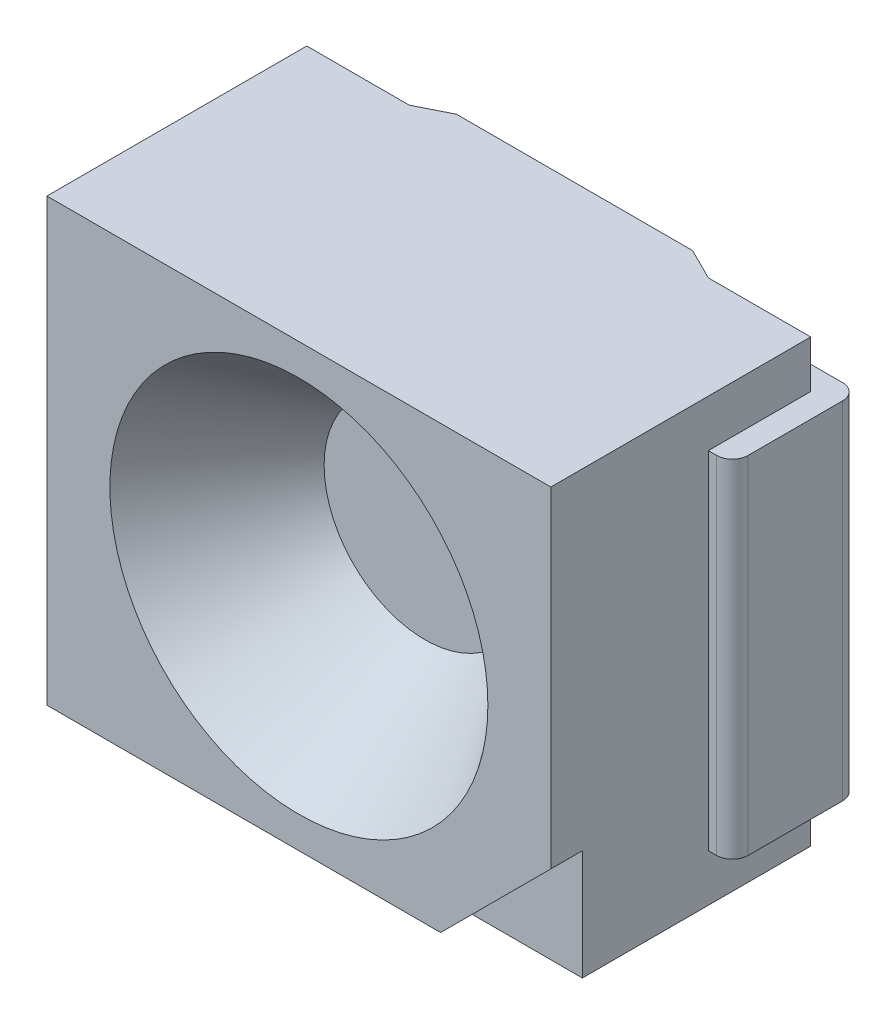
ISO-10303-21;
HEADER;
FILE_DESCRIPTION(('STEP AP214'),'2;1');
FILE_NAME('part.step','',(''),(''),'','','');
FILE_SCHEMA(('AUTOMOTIVE_DESIGN { 1 0 10303 214 1 1 1 1 }'));
ENDSEC;
DATA;
#1=APPLICATION_CONTEXT('core data for automotive mechanical design processes');
#2=APPLICATION_PROTOCOL_DEFINITION('international standard','automotive_design',2000,#1);
#3=PRODUCT_CONTEXT('',#1,'mechanical');
#4=PRODUCT('Part','Part','',(#3));
#5=PRODUCT_RELATED_PRODUCT_CATEGORY('part','',(#4));
#6=PRODUCT_DEFINITION_FORMATION('','',#4);
#7=PRODUCT_DEFINITION_CONTEXT('part definition',#1,'design');
#8=PRODUCT_DEFINITION('design','',#6,#7);
#9=PRODUCT_DEFINITION_SHAPE('','',#8);
#10=(LENGTH_UNIT() NAMED_UNIT(*) SI_UNIT(.MILLI.,.METRE.));
#11=(NAMED_UNIT(*) PLANE_ANGLE_UNIT() SI_UNIT($,.RADIAN.));
#12=(NAMED_UNIT(*) SI_UNIT($,.STERADIAN.) SOLID_ANGLE_UNIT());
#13=UNCERTAINTY_MEASURE_WITH_UNIT(LENGTH_MEASURE(1.E-05),#10,'distance_accuracy_value','');
#14=(GEOMETRIC_REPRESENTATION_CONTEXT(3) GLOBAL_UNCERTAINTY_ASSIGNED_CONTEXT((#13)) GLOBAL_UNIT_ASSIGNED_CONTEXT((#10,
#11,#12)) REPRESENTATION_CONTEXT('',''));
#15=CARTESIAN_POINT('',(0.,0.,0.));
#16=DIRECTION('',(0.,0.,1.));
#17=DIRECTION('',(1.,0.,0.));
#18=AXIS2_PLACEMENT_3D('',#15,#16,#17);
#19=CARTESIAN_POINT('',(3.2,0.,1.75));
#20=DIRECTION('',(-1.,0.,0.));
#21=DIRECTION('',(0.,-1.,0.));
#22=AXIS2_PLACEMENT_3D('',#19,#20,#21);
#23=PLANE('',#22);
#24=DIRECTION('',(0.,0.,-1.));
#25=VECTOR('',#24,1.);
#26=CARTESIAN_POINT('',(3.2,2.5,0.75));
#27=LINE('',#26,#25);
#28=CARTESIAN_POINT('',(3.2,2.5,0.75));
#29=VERTEX_POINT('',#28);
#30=CARTESIAN_POINT('',(3.2,2.5,0.1));
#31=VERTEX_POINT('',#30);
#32=EDGE_CURVE('E221',#29,#31,#27,.T.);
#33=ORIENTED_EDGE('',*,*,#32,.T.);
#34=DIRECTION('',(0.,-1.,0.));
#35=VECTOR('',#34,1.);
#36=CARTESIAN_POINT('',(3.2,2.8,0.1));
#37=LINE('',#36,#35);
#38=CARTESIAN_POINT('',(3.2,2.8,0.1));
#39=VERTEX_POINT('',#38);
#40=EDGE_CURVE('E318',#39,#31,#37,.T.);
#41=ORIENTED_EDGE('',*,*,#40,.F.);
#42=DIRECTION('',(0.,0.,-1.));
#43=VECTOR('',#42,1.);
#44=CARTESIAN_POINT('',(3.2,2.8,1.75));
#45=LINE('',#44,#43);
#46=CARTESIAN_POINT('',(3.2,2.8,1.75));
#47=VERTEX_POINT('',#46);
#48=EDGE_CURVE('E379',#47,#39,#45,.T.);
#49=ORIENTED_EDGE('',*,*,#48,.F.);
#50=DIRECTION('',(0.,1.,0.));
#51=VECTOR('',#50,1.);
#52=CARTESIAN_POINT('',(3.2,0.,1.75));
#53=LINE('',#52,#51);
#54=CARTESIAN_POINT('',(3.2,0.7,1.75));
#55=VERTEX_POINT('',#54);
#56=EDGE_CURVE('E369',#55,#47,#53,.T.);
#57=ORIENTED_EDGE('',*,*,#56,.F.);
#58=DIRECTION('',(0.,0.,1.));
#59=VECTOR('',#58,1.);
#60=CARTESIAN_POINT('',(3.2,0.7,1.55));
#61=LINE('',#60,#59);
#62=CARTESIAN_POINT('',(3.2,0.7,1.55));
#63=VERTEX_POINT('',#62);
#64=EDGE_CURVE('E355',#63,#55,#61,.T.);
#65=ORIENTED_EDGE('',*,*,#64,.F.);
#66=DIRECTION('',(0.,1.,0.));
#67=VECTOR('',#66,1.);
#68=CARTESIAN_POINT('',(3.2,0.,1.55));
#69=LINE('',#68,#67);
#70=CARTESIAN_POINT('',(3.2,0.,1.55));
#71=VERTEX_POINT('',#70);
#72=EDGE_CURVE('E350',#71,#63,#69,.T.);
#73=ORIENTED_EDGE('',*,*,#72,.F.);
#74=DIRECTION('',(0.,0.,-1.));
#75=VECTOR('',#74,1.);
#76=CARTESIAN_POINT('',(3.2,0.,1.75));
#77=LINE('',#76,#75);
#78=CARTESIAN_POINT('',(3.2,0.,0.1));
#79=VERTEX_POINT('',#78);
#80=EDGE_CURVE('E382',#71,#79,#77,.T.);
#81=ORIENTED_EDGE('',*,*,#80,.T.);
#82=CARTESIAN_POINT('',(3.2,0.299999999999999,0.1));
#83=VERTEX_POINT('',#82);
#84=EDGE_CURVE('E308',#83,#79,#37,.T.);
#85=ORIENTED_EDGE('',*,*,#84,.F.);
#86=DIRECTION('',(0.,0.,-1.));
#87=VECTOR('',#86,1.);
#88=CARTESIAN_POINT('',(3.2,0.299999999999999,0.75));
#89=LINE('',#88,#87);
#90=CARTESIAN_POINT('',(3.2,0.299999999999999,0.75));
#91=VERTEX_POINT('',#90);
#92=EDGE_CURVE('E230',#91,#83,#89,.T.);
#93=ORIENTED_EDGE('',*,*,#92,.F.);
#94=DIRECTION('',(0.,-1.,0.));
#95=VECTOR('',#94,1.);
#96=CARTESIAN_POINT('',(3.2,0.299999999999999,0.75));
#97=LINE('',#96,#95);
#98=EDGE_CURVE('E213',#29,#91,#97,.T.);
#99=ORIENTED_EDGE('',*,*,#98,.F.);
#100=EDGE_LOOP('',(#33,#41,#49,#57,#65,#73,#81,#85,#93,#99));
#101=FACE_BOUND('',#100,.T.);
#102=ADVANCED_FACE('F35',(#101),#23,.F.);
#103=CARTESIAN_POINT('',(0.,0.,1.75));
#104=DIRECTION('',(1.,0.,0.));
#105=DIRECTION('',(0.,0.,-1.));
#106=AXIS2_PLACEMENT_3D('',#103,#104,#105);
#107=PLANE('',#106);
#108=DIRECTION('',(0.,0.,-1.));
#109=VECTOR('',#108,1.);
#110=CARTESIAN_POINT('',(0.,0.299999999999999,0.75));
#111=LINE('',#110,#109);
#112=CARTESIAN_POINT('',(0.,0.299999999999999,0.75));
#113=VERTEX_POINT('',#112);
#114=CARTESIAN_POINT('',(0.,0.299999999999999,0.1));
#115=VERTEX_POINT('',#114);
#116=EDGE_CURVE('E248',#113,#115,#111,.T.);
#117=ORIENTED_EDGE('',*,*,#116,.T.);
#118=DIRECTION('',(0.,-1.,0.));
#119=VECTOR('',#118,1.);
#120=CARTESIAN_POINT('',(0.,2.8,0.1));
#121=LINE('',#120,#119);
#122=CARTESIAN_POINT('',(0.,0.,0.1));
#123=VERTEX_POINT('',#122);
#124=EDGE_CURVE('E336',#115,#123,#121,.T.);
#125=ORIENTED_EDGE('',*,*,#124,.T.);
#126=DIRECTION('',(0.,0.,-1.));
#127=VECTOR('',#126,1.);
#128=CARTESIAN_POINT('',(0.,0.,1.75));
#129=LINE('',#128,#127);
#130=CARTESIAN_POINT('',(0.,0.,1.75));
#131=VERTEX_POINT('',#130);
#132=EDGE_CURVE('E385',#131,#123,#129,.T.);
#133=ORIENTED_EDGE('',*,*,#132,.F.);
#134=DIRECTION('',(0.,-1.,0.));
#135=VECTOR('',#134,1.);
#136=CARTESIAN_POINT('',(0.,0.,1.75));
#137=LINE('',#136,#135);
#138=CARTESIAN_POINT('',(0.,2.8,1.75));
#139=VERTEX_POINT('',#138);
#140=EDGE_CURVE('E362',#139,#131,#137,.T.);
#141=ORIENTED_EDGE('',*,*,#140,.F.);
#142=DIRECTION('',(0.,0.,-1.));
#143=VECTOR('',#142,1.);
#144=CARTESIAN_POINT('',(0.,2.8,1.75));
#145=LINE('',#144,#143);
#146=CARTESIAN_POINT('',(0.,2.8,0.1));
#147=VERTEX_POINT('',#146);
#148=EDGE_CURVE('E373',#139,#147,#145,.T.);
#149=ORIENTED_EDGE('',*,*,#148,.T.);
#150=CARTESIAN_POINT('',(0.,2.5,0.1));
#151=VERTEX_POINT('',#150);
#152=EDGE_CURVE('E332',#147,#151,#121,.T.);
#153=ORIENTED_EDGE('',*,*,#152,.T.);
#154=DIRECTION('',(0.,0.,-1.));
#155=VECTOR('',#154,1.);
#156=CARTESIAN_POINT('',(0.,2.5,0.75));
#157=LINE('',#156,#155);
#158=CARTESIAN_POINT('',(0.,2.5,0.75));
#159=VERTEX_POINT('',#158);
#160=EDGE_CURVE('E246',#159,#151,#157,.T.);
#161=ORIENTED_EDGE('',*,*,#160,.F.);
#162=DIRECTION('',(0.,1.,0.));
#163=VECTOR('',#162,1.);
#164=CARTESIAN_POINT('',(0.,2.5,0.75));
#165=LINE('',#164,#163);
#166=EDGE_CURVE('E241',#113,#159,#165,.T.);
#167=ORIENTED_EDGE('',*,*,#166,.F.);
#168=EDGE_LOOP('',(#117,#125,#133,#141,#149,#153,#161,#167));
#169=FACE_BOUND('',#168,.T.);
#170=ADVANCED_FACE('F443',(#169),#107,.F.);
#171=CARTESIAN_POINT('',(0.,2.8,0.1));
#172=DIRECTION('',(0.,0.,1.));
#173=DIRECTION('',(1.,0.,0.));
#174=AXIS2_PLACEMENT_3D('',#171,#172,#173);
#175=PLANE('',#174);
#176=DIRECTION('',(-1.,0.,0.));
#177=VECTOR('',#176,1.);
#178=CARTESIAN_POINT('',(0.65,0.299999999999999,0.1));
#179=LINE('',#178,#177);
#180=CARTESIAN_POINT('',(0.65,0.299999999999999,0.1));
#181=VERTEX_POINT('',#180);
#182=EDGE_CURVE('E263',#181,#115,#179,.T.);
#183=ORIENTED_EDGE('',*,*,#182,.F.);
#184=DIRECTION('',(0.,-1.,0.));
#185=VECTOR('',#184,1.);
#186=CARTESIAN_POINT('',(0.65,2.8,0.1));
#187=LINE('',#186,#185);
#188=CARTESIAN_POINT('',(0.65,0.,0.1));
#189=VERTEX_POINT('',#188);
#190=EDGE_CURVE('E340',#181,#189,#187,.T.);
#191=ORIENTED_EDGE('',*,*,#190,.T.);
#192=DIRECTION('',(-1.,0.,0.));
#193=VECTOR('',#192,1.);
#194=CARTESIAN_POINT('',(0.,0.,0.1));
#195=LINE('',#194,#193);
#196=EDGE_CURVE('E324',#189,#123,#195,.T.);
#197=ORIENTED_EDGE('',*,*,#196,.T.);
#198=ORIENTED_EDGE('',*,*,#124,.F.);
#199=EDGE_LOOP('',(#183,#191,#197,#198));
#200=FACE_BOUND('',#199,.T.);
#201=ADVANCED_FACE('F457',(#200),#175,.F.);
#202=DIRECTION('',(1.,0.,0.));
#203=VECTOR('',#202,1.);
#204=CARTESIAN_POINT('',(0.65,2.5,0.1));
#205=LINE('',#204,#203);
#206=CARTESIAN_POINT('',(0.65,2.5,0.1));
#207=VERTEX_POINT('',#206);
#208=EDGE_CURVE('E255',#151,#207,#205,.T.);
#209=ORIENTED_EDGE('',*,*,#208,.F.);
#210=ORIENTED_EDGE('',*,*,#152,.F.);
#211=DIRECTION('',(-1.,0.,0.));
#212=VECTOR('',#211,1.);
#213=CARTESIAN_POINT('',(0.,2.8,0.1));
#214=LINE('',#213,#212);
#215=CARTESIAN_POINT('',(0.65,2.8,0.1));
#216=VERTEX_POINT('',#215);
#217=EDGE_CURVE('E323',#216,#147,#214,.T.);
#218=ORIENTED_EDGE('',*,*,#217,.F.);
#219=EDGE_CURVE('E337',#216,#207,#187,.T.);
#220=ORIENTED_EDGE('',*,*,#219,.T.);
#221=EDGE_LOOP('',(#209,#210,#218,#220));
#222=FACE_BOUND('',#221,.T.);
#223=ADVANCED_FACE('F447',(#222),#175,.F.);
#224=CARTESIAN_POINT('',(2.55,2.8,0.1));
#225=DIRECTION('',(0.,0.,1.));
#226=DIRECTION('',(1.,0.,0.));
#227=AXIS2_PLACEMENT_3D('',#224,#225,#226);
#228=PLANE('',#227);
#229=DIRECTION('',(-1.,0.,0.));
#230=VECTOR('',#229,1.);
#231=CARTESIAN_POINT('',(2.55,0.299999999999999,0.1));
#232=LINE('',#231,#230);
#233=CARTESIAN_POINT('',(2.55245720732132,0.299999999999999,0.1));
#234=VERTEX_POINT('',#233);
#235=EDGE_CURVE('E388',#83,#234,#232,.T.);
#236=ORIENTED_EDGE('',*,*,#235,.F.);
#237=ORIENTED_EDGE('',*,*,#84,.T.);
#238=DIRECTION('',(-1.,0.,0.));
#239=VECTOR('',#238,1.);
#240=CARTESIAN_POINT('',(2.55,0.,0.1));
#241=LINE('',#240,#239);
#242=CARTESIAN_POINT('',(2.55,0.,0.1));
#243=VERTEX_POINT('',#242);
#244=EDGE_CURVE('E300',#79,#243,#241,.T.);
#245=ORIENTED_EDGE('',*,*,#244,.T.);
#246=DIRECTION('',(0.,-1.,0.));
#247=VECTOR('',#246,1.);
#248=CARTESIAN_POINT('',(2.55,2.8,0.1));
#249=LINE('',#248,#247);
#250=CARTESIAN_POINT('',(2.55,2.8,0.1));
#251=VERTEX_POINT('',#250);
#252=EDGE_CURVE('E316',#251,#243,#249,.T.);
#253=ORIENTED_EDGE('',*,*,#252,.F.);
#254=DIRECTION('',(-1.,0.,0.));
#255=VECTOR('',#254,1.);
#256=CARTESIAN_POINT('',(2.55,2.8,0.1));
#257=LINE('',#256,#255);
#258=EDGE_CURVE('E301',#39,#251,#257,.T.);
#259=ORIENTED_EDGE('',*,*,#258,.F.);
#260=ORIENTED_EDGE('',*,*,#40,.T.);
#261=DIRECTION('',(1.,0.,0.));
#262=VECTOR('',#261,1.);
#263=CARTESIAN_POINT('',(3.35245720732132,2.5,0.1));
#264=LINE('',#263,#262);
#265=CARTESIAN_POINT('',(2.55245720732132,2.5,0.1));
#266=VERTEX_POINT('',#265);
#267=EDGE_CURVE('E225',#266,#31,#264,.T.);
#268=ORIENTED_EDGE('',*,*,#267,.F.);
#269=DIRECTION('',(0.,1.,0.));
#270=VECTOR('',#269,1.);
#271=CARTESIAN_POINT('',(2.55245720732132,2.5,0.1));
#272=LINE('',#271,#270);
#273=EDGE_CURVE('E278',#234,#266,#272,.T.);
#274=ORIENTED_EDGE('',*,*,#273,.F.);
#275=EDGE_LOOP('',(#236,#237,#245,#253,#259,#260,#268,#274));
#276=FACE_BOUND('',#275,.T.);
#277=ADVANCED_FACE('F486',(#276),#228,.F.);
#278=CARTESIAN_POINT('',(0.,0.,1.75));
#279=DIRECTION('',(0.,1.,0.));
#280=DIRECTION('',(0.,0.,1.));
#281=AXIS2_PLACEMENT_3D('',#278,#279,#280);
#282=PLANE('',#281);
#283=DIRECTION('',(1.,0.,0.));
#284=VECTOR('',#283,1.);
#285=CARTESIAN_POINT('',(0.,0.,0.));
#286=LINE('',#285,#284);
#287=CARTESIAN_POINT('',(0.85,0.,0.));
#288=VERTEX_POINT('',#287);
#289=CARTESIAN_POINT('',(2.35,0.,0.));
#290=VERTEX_POINT('',#289);
#291=EDGE_CURVE('E360',#288,#290,#286,.T.);
#292=ORIENTED_EDGE('',*,*,#291,.T.);
#293=DIRECTION('',(-0.894427190999916,0.,-0.447213595499959));
#294=VECTOR('',#293,1.);
#295=CARTESIAN_POINT('',(2.55,0.,0.1));
#296=LINE('',#295,#294);
#297=EDGE_CURVE('E305',#243,#290,#296,.T.);
#298=ORIENTED_EDGE('',*,*,#297,.F.);
#299=ORIENTED_EDGE('',*,*,#244,.F.);
#300=ORIENTED_EDGE('',*,*,#80,.F.);
#301=DIRECTION('',(1.,0.,0.));
#302=VECTOR('',#301,1.);
#303=CARTESIAN_POINT('',(2.5,0.,1.55));
#304=LINE('',#303,#302);
#305=CARTESIAN_POINT('',(2.5,0.,1.55));
#306=VERTEX_POINT('',#305);
#307=EDGE_CURVE('E348',#306,#71,#304,.T.);
#308=ORIENTED_EDGE('',*,*,#307,.F.);
#309=DIRECTION('',(0.,0.,1.));
#310=VECTOR('',#309,1.);
#311=CARTESIAN_POINT('',(2.5,0.,1.55));
#312=LINE('',#311,#310);
#313=CARTESIAN_POINT('',(2.5,0.,1.75));
#314=VERTEX_POINT('',#313);
#315=EDGE_CURVE('E357',#306,#314,#312,.T.);
#316=ORIENTED_EDGE('',*,*,#315,.T.);
#317=DIRECTION('',(1.,0.,0.));
#318=VECTOR('',#317,1.);
#319=CARTESIAN_POINT('',(0.,0.,1.75));
#320=LINE('',#319,#318);
#321=EDGE_CURVE('E365',#131,#314,#320,.T.);
#322=ORIENTED_EDGE('',*,*,#321,.F.);
#323=ORIENTED_EDGE('',*,*,#132,.T.);
#324=ORIENTED_EDGE('',*,*,#196,.F.);
#325=DIRECTION('',(-0.894427190999916,0.,0.447213595499959));
#326=VECTOR('',#325,1.);
#327=CARTESIAN_POINT('',(0.65,0.,0.1));
#328=LINE('',#327,#326);
#329=EDGE_CURVE('E315',#288,#189,#328,.T.);
#330=ORIENTED_EDGE('',*,*,#329,.F.);
#331=EDGE_LOOP('',(#292,#298,#299,#300,#308,#316,#322,#323,#324,#330));
#332=FACE_BOUND('',#331,.T.);
#333=ADVANCED_FACE('F462',(#332),#282,.F.);
#334=CARTESIAN_POINT('',(0.,2.8,1.75));
#335=DIRECTION('',(0.,-1.,0.));
#336=DIRECTION('',(0.,0.,-1.));
#337=AXIS2_PLACEMENT_3D('',#334,#335,#336);
#338=PLANE('',#337);
#339=ORIENTED_EDGE('',*,*,#258,.T.);
#340=DIRECTION('',(-0.894427190999916,0.,-0.447213595499959));
#341=VECTOR('',#340,1.);
#342=CARTESIAN_POINT('',(2.55,2.8,0.1));
#343=LINE('',#342,#341);
#344=CARTESIAN_POINT('',(2.35,2.8,0.));
#345=VERTEX_POINT('',#344);
#346=EDGE_CURVE('E304',#251,#345,#343,.T.);
#347=ORIENTED_EDGE('',*,*,#346,.T.);
#348=DIRECTION('',(-1.,0.,0.));
#349=VECTOR('',#348,1.);
#350=CARTESIAN_POINT('',(0.,2.8,0.));
#351=LINE('',#350,#349);
#352=CARTESIAN_POINT('',(0.85,2.8,0.));
#353=VERTEX_POINT('',#352);
#354=EDGE_CURVE('E366',#345,#353,#351,.T.);
#355=ORIENTED_EDGE('',*,*,#354,.T.);
#356=DIRECTION('',(-0.894427190999916,0.,0.447213595499959));
#357=VECTOR('',#356,1.);
#358=CARTESIAN_POINT('',(0.65,2.8,0.1));
#359=LINE('',#358,#357);
#360=EDGE_CURVE('E320',#353,#216,#359,.T.);
#361=ORIENTED_EDGE('',*,*,#360,.T.);
#362=ORIENTED_EDGE('',*,*,#217,.T.);
#363=ORIENTED_EDGE('',*,*,#148,.F.);
#364=DIRECTION('',(-1.,0.,0.));
#365=VECTOR('',#364,1.);
#366=CARTESIAN_POINT('',(0.,2.8,1.75));
#367=LINE('',#366,#365);
#368=EDGE_CURVE('E371',#47,#139,#367,.T.);
#369=ORIENTED_EDGE('',*,*,#368,.F.);
#370=ORIENTED_EDGE('',*,*,#48,.T.);
#371=EDGE_LOOP('',(#339,#347,#355,#361,#362,#363,#369,#370));
#372=FACE_BOUND('',#371,.T.);
#373=ADVANCED_FACE('F473',(#372),#338,.F.);
#374=CARTESIAN_POINT('',(0.,0.,1.75));
#375=DIRECTION('',(0.,0.,-1.));
#376=DIRECTION('',(-1.,0.,0.));
#377=AXIS2_PLACEMENT_3D('',#374,#375,#376);
#378=PLANE('',#377);
#379=CARTESIAN_POINT('',(1.6,1.4,1.75));
#380=DIRECTION('',(0.,0.,1.));
#381=DIRECTION('',(1.,0.,0.));
#382=AXIS2_PLACEMENT_3D('',#379,#380,#381);
#383=CIRCLE('',#382,1.2);
#384=CARTESIAN_POINT('',(2.8,1.4,1.75));
#385=VERTEX_POINT('',#384);
#386=EDGE_CURVE('E335',#385,#385,#383,.T.);
#387=ORIENTED_EDGE('',*,*,#386,.F.);
#388=EDGE_LOOP('',(#387));
#389=FACE_BOUND('',#388,.T.);
#390=ORIENTED_EDGE('',*,*,#321,.T.);
#391=DIRECTION('',(-0.707106781186548,-0.707106781186547,0.));
#392=VECTOR('',#391,1.);
#393=CARTESIAN_POINT('',(3.2,0.7,1.75));
#394=LINE('',#393,#392);
#395=EDGE_CURVE('E347',#55,#314,#394,.T.);
#396=ORIENTED_EDGE('',*,*,#395,.F.);
#397=ORIENTED_EDGE('',*,*,#56,.T.);
#398=ORIENTED_EDGE('',*,*,#368,.T.);
#399=ORIENTED_EDGE('',*,*,#140,.T.);
#400=EDGE_LOOP('',(#390,#396,#397,#398,#399));
#401=FACE_BOUND('',#400,.T.);
#402=ADVANCED_FACE('F467',(#389,#401),#378,.F.);
#403=CARTESIAN_POINT('',(0.,0.,0.));
#404=DIRECTION('',(0.,0.,-1.));
#405=DIRECTION('',(-1.,0.,0.));
#406=AXIS2_PLACEMENT_3D('',#403,#404,#405);
#407=PLANE('',#406);
#408=CARTESIAN_POINT('',(1.6,1.4,0.));
#409=DIRECTION('',(0.,0.,-1.));
#410=DIRECTION('',(-1.,0.,0.));
#411=AXIS2_PLACEMENT_3D('',#408,#409,#410);
#412=CIRCLE('',#411,0.3);
#413=CARTESIAN_POINT('',(1.3,1.4,0.));
#414=VERTEX_POINT('',#413);
#415=EDGE_CURVE('E569',#414,#414,#412,.T.);
#416=ORIENTED_EDGE('',*,*,#415,.F.);
#417=EDGE_LOOP('',(#416));
#418=FACE_BOUND('',#417,.T.);
#419=DIRECTION('',(0.,-1.,0.));
#420=VECTOR('',#419,1.);
#421=CARTESIAN_POINT('',(2.35,2.8,0.));
#422=LINE('',#421,#420);
#423=EDGE_CURVE('E312',#345,#290,#422,.T.);
#424=ORIENTED_EDGE('',*,*,#423,.T.);
#425=ORIENTED_EDGE('',*,*,#291,.F.);
#426=DIRECTION('',(0.,-1.,0.));
#427=VECTOR('',#426,1.);
#428=CARTESIAN_POINT('',(0.85,2.8,0.));
#429=LINE('',#428,#427);
#430=EDGE_CURVE('E327',#353,#288,#429,.T.);
#431=ORIENTED_EDGE('',*,*,#430,.F.);
#432=ORIENTED_EDGE('',*,*,#354,.F.);
#433=EDGE_LOOP('',(#424,#425,#431,#432));
#434=FACE_BOUND('',#433,.T.);
#435=ADVANCED_FACE('F477',(#418,#434),#407,.T.);
#436=CARTESIAN_POINT('',(3.2,0.7,1.55));
#437=DIRECTION('',(-0.707106781186548,0.707106781186548,0.));
#438=DIRECTION('',(-0.707106781186548,-0.707106781186548,0.));
#439=AXIS2_PLACEMENT_3D('',#436,#437,#438);
#440=PLANE('',#439);
#441=ORIENTED_EDGE('',*,*,#395,.T.);
#442=ORIENTED_EDGE('',*,*,#315,.F.);
#443=DIRECTION('',(-0.707106781186548,-0.707106781186547,0.));
#444=VECTOR('',#443,1.);
#445=CARTESIAN_POINT('',(3.2,0.7,1.55));
#446=LINE('',#445,#444);
#447=EDGE_CURVE('E352',#63,#306,#446,.T.);
#448=ORIENTED_EDGE('',*,*,#447,.F.);
#449=ORIENTED_EDGE('',*,*,#64,.T.);
#450=EDGE_LOOP('',(#441,#442,#448,#449));
#451=FACE_BOUND('',#450,.T.);
#452=ADVANCED_FACE('F493',(#451),#440,.F.);
#453=CARTESIAN_POINT('',(0.,0.,1.55));
#454=DIRECTION('',(0.,0.,1.));
#455=DIRECTION('',(1.,0.,0.));
#456=AXIS2_PLACEMENT_3D('',#453,#454,#455);
#457=PLANE('',#456);
#458=ORIENTED_EDGE('',*,*,#307,.T.);
#459=ORIENTED_EDGE('',*,*,#72,.T.);
#460=ORIENTED_EDGE('',*,*,#447,.T.);
#461=EDGE_LOOP('',(#458,#459,#460));
#462=FACE_BOUND('',#461,.T.);
#463=ADVANCED_FACE('F490',(#462),#457,.T.);
#464=CARTESIAN_POINT('',(1.6,1.4,1.75));
#465=DIRECTION('',(0.,0.,1.));
#466=DIRECTION('',(1.,0.,0.));
#467=AXIS2_PLACEMENT_3D('',#464,#465,#466);
#468=CONICAL_SURFACE('',#467,1.2,0.610865238198016);
#469=CARTESIAN_POINT('',(1.6,1.4,0.95));
#470=DIRECTION('',(0.,0.,1.));
#471=DIRECTION('',(1.,0.,0.));
#472=AXIS2_PLACEMENT_3D('',#469,#470,#471);
#473=CIRCLE('',#472,0.639833969432232);
#474=CARTESIAN_POINT('',(2.23983396943223,1.4,0.95));
#475=VERTEX_POINT('',#474);
#476=EDGE_CURVE('E344',#475,#475,#473,.T.);
#477=ORIENTED_EDGE('',*,*,#476,.F.);
#478=EDGE_LOOP('',(#477));
#479=FACE_BOUND('',#478,.T.);
#480=ORIENTED_EDGE('',*,*,#386,.T.);
#481=EDGE_LOOP('',(#480));
#482=FACE_BOUND('',#481,.T.);
#483=ADVANCED_FACE('F552',(#479,#482),#468,.F.);
#484=CARTESIAN_POINT('',(1.6,1.4,0.95));
#485=DIRECTION('',(0.,0.,1.));
#486=DIRECTION('',(1.,0.,0.));
#487=AXIS2_PLACEMENT_3D('',#484,#485,#486);
#488=PLANE('',#487);
#489=ORIENTED_EDGE('',*,*,#476,.T.);
#490=EDGE_LOOP('',(#489));
#491=FACE_BOUND('',#490,.T.);
#492=ADVANCED_FACE('F549',(#491),#488,.T.);
#493=CARTESIAN_POINT('',(0.65,2.8,0.1));
#494=DIRECTION('',(0.447213595499959,0.,0.894427190999916));
#495=DIRECTION('',(0.894427190999916,0.,-0.447213595499959));
#496=AXIS2_PLACEMENT_3D('',#493,#494,#495);
#497=PLANE('',#496);
#498=ORIENTED_EDGE('',*,*,#329,.T.);
#499=ORIENTED_EDGE('',*,*,#190,.F.);
#500=DIRECTION('',(0.,-1.,0.));
#501=VECTOR('',#500,1.);
#502=CARTESIAN_POINT('',(0.65,2.5,0.1));
#503=LINE('',#502,#501);
#504=EDGE_CURVE('E250',#207,#181,#503,.T.);
#505=ORIENTED_EDGE('',*,*,#504,.F.);
#506=ORIENTED_EDGE('',*,*,#219,.F.);
#507=ORIENTED_EDGE('',*,*,#360,.F.);
#508=ORIENTED_EDGE('',*,*,#430,.T.);
#509=EDGE_LOOP('',(#498,#499,#505,#506,#507,#508));
#510=FACE_BOUND('',#509,.T.);
#511=ADVANCED_FACE('F451',(#510),#497,.F.);
#512=CARTESIAN_POINT('',(2.55,2.8,0.1));
#513=DIRECTION('',(-0.447213595499959,0.,0.894427190999916));
#514=DIRECTION('',(0.894427190999916,0.,0.447213595499959));
#515=AXIS2_PLACEMENT_3D('',#512,#513,#514);
#516=PLANE('',#515);
#517=ORIENTED_EDGE('',*,*,#297,.T.);
#518=ORIENTED_EDGE('',*,*,#423,.F.);
#519=ORIENTED_EDGE('',*,*,#346,.F.);
#520=ORIENTED_EDGE('',*,*,#252,.T.);
#521=EDGE_LOOP('',(#517,#518,#519,#520));
#522=FACE_BOUND('',#521,.T.);
#523=ADVANCED_FACE('F483',(#522),#516,.F.);
#524=CARTESIAN_POINT('',(3.35245720732132,2.5,-0.0499999999999995));
#525=DIRECTION('',(-1.,0.,0.));
#526=DIRECTION('',(0.,0.,1.));
#527=AXIS2_PLACEMENT_3D('',#524,#525,#526);
#528=PLANE('',#527);
#529=DIRECTION('',(0.,0.,1.));
#530=VECTOR('',#529,1.);
#531=CARTESIAN_POINT('',(3.35245720732132,0.299999999999999,-0.0499999999999995));
#532=LINE('',#531,#530);
#533=CARTESIAN_POINT('',(3.35245720732132,0.299999999999999,0.0500000000000005));
#534=VERTEX_POINT('',#533);
#535=CARTESIAN_POINT('',(3.35245720732132,0.299999999999999,0.65));
#536=VERTEX_POINT('',#535);
#537=EDGE_CURVE('E297',#534,#536,#532,.T.);
#538=ORIENTED_EDGE('',*,*,#537,.F.);
#539=DIRECTION('',(0.,-1.,0.));
#540=VECTOR('',#539,1.);
#541=CARTESIAN_POINT('',(3.35245720732132,2.5,0.0500000000000005));
#542=LINE('',#541,#540);
#543=CARTESIAN_POINT('',(3.35245720732132,2.5,0.0500000000000005));
#544=VERTEX_POINT('',#543);
#545=EDGE_CURVE('E400',#534,#544,#542,.F.);
#546=ORIENTED_EDGE('',*,*,#545,.T.);
#547=DIRECTION('',(0.,0.,1.));
#548=VECTOR('',#547,1.);
#549=CARTESIAN_POINT('',(3.35245720732132,2.5,-0.0499999999999995));
#550=LINE('',#549,#548);
#551=CARTESIAN_POINT('',(3.35245720732132,2.5,0.65));
#552=VERTEX_POINT('',#551);
#553=EDGE_CURVE('E286',#544,#552,#550,.T.);
#554=ORIENTED_EDGE('',*,*,#553,.T.);
#555=DIRECTION('',(0.,1.,0.));
#556=VECTOR('',#555,1.);
#557=CARTESIAN_POINT('',(3.35245720732132,0.299999999999999,0.65));
#558=LINE('',#557,#556);
#559=EDGE_CURVE('E398',#552,#536,#558,.F.);
#560=ORIENTED_EDGE('',*,*,#559,.T.);
#561=EDGE_LOOP('',(#538,#546,#554,#560));
#562=FACE_BOUND('',#561,.T.);
#563=ADVANCED_FACE('F513',(#562),#528,.F.);
#564=CARTESIAN_POINT('',(3.35245720732132,0.299999999999999,-0.0499999999999995));
#565=DIRECTION('',(0.,1.,0.));
#566=DIRECTION('',(0.,0.,1.));
#567=AXIS2_PLACEMENT_3D('',#564,#565,#566);
#568=PLANE('',#567);
#569=DIRECTION('',(-1.,0.,0.));
#570=VECTOR('',#569,1.);
#571=CARTESIAN_POINT('',(3.35245720732132,0.299999999999999,-0.0499999999999995));
#572=LINE('',#571,#570);
#573=CARTESIAN_POINT('',(3.25245720732132,0.299999999999999,-0.0499999999999995));
#574=VERTEX_POINT('',#573);
#575=CARTESIAN_POINT('',(2.55245720732132,0.299999999999999,-0.0499999999999995));
#576=VERTEX_POINT('',#575);
#577=EDGE_CURVE('E279',#574,#576,#572,.T.);
#578=ORIENTED_EDGE('',*,*,#577,.F.);
#579=CARTESIAN_POINT('',(3.25245720732132,0.299999999999999,0.0500000000000005));
#580=DIRECTION('',(0.,1.,0.));
#581=DIRECTION('',(0.,0.,1.));
#582=AXIS2_PLACEMENT_3D('',#579,#580,#581);
#583=CIRCLE('',#582,0.1);
#584=EDGE_CURVE('E396',#574,#534,#583,.F.);
#585=ORIENTED_EDGE('',*,*,#584,.T.);
#586=ORIENTED_EDGE('',*,*,#537,.T.);
#587=CARTESIAN_POINT('',(3.25245720732132,0.299999999999999,0.65));
#588=DIRECTION('',(0.,1.,0.));
#589=DIRECTION('',(0.,0.,1.));
#590=AXIS2_PLACEMENT_3D('',#587,#588,#589);
#591=CIRCLE('',#590,0.1);
#592=CARTESIAN_POINT('',(3.25245720732132,0.299999999999999,0.75));
#593=VERTEX_POINT('',#592);
#594=EDGE_CURVE('E394',#536,#593,#591,.F.);
#595=ORIENTED_EDGE('',*,*,#594,.T.);
#596=DIRECTION('',(1.,0.,0.));
#597=VECTOR('',#596,1.);
#598=CARTESIAN_POINT('',(3.35245720732132,0.299999999999999,0.75));
#599=LINE('',#598,#597);
#600=EDGE_CURVE('E234',#91,#593,#599,.T.);
#601=ORIENTED_EDGE('',*,*,#600,.F.);
#602=ORIENTED_EDGE('',*,*,#92,.T.);
#603=ORIENTED_EDGE('',*,*,#235,.T.);
#604=DIRECTION('',(0.,0.,1.));
#605=VECTOR('',#604,1.);
#606=CARTESIAN_POINT('',(2.55245720732132,0.299999999999999,-0.0499999999999995));
#607=LINE('',#606,#605);
#608=EDGE_CURVE('E294',#576,#234,#607,.T.);
#609=ORIENTED_EDGE('',*,*,#608,.F.);
#610=EDGE_LOOP('',(#578,#585,#586,#595,#601,#602,#603,#609));
#611=FACE_BOUND('',#610,.T.);
#612=ADVANCED_FACE('F510',(#611),#568,.F.);
#613=CARTESIAN_POINT('',(2.55245720732132,2.5,-0.0499999999999995));
#614=DIRECTION('',(1.,0.,0.));
#615=DIRECTION('',(0.,1.,0.));
#616=AXIS2_PLACEMENT_3D('',#613,#614,#615);
#617=PLANE('',#616);
#618=ORIENTED_EDGE('',*,*,#273,.T.);
#619=DIRECTION('',(0.,0.,1.));
#620=VECTOR('',#619,1.);
#621=CARTESIAN_POINT('',(2.55245720732132,2.5,-0.0499999999999995));
#622=LINE('',#621,#620);
#623=CARTESIAN_POINT('',(2.55245720732132,2.5,-0.0499999999999995));
#624=VERTEX_POINT('',#623);
#625=EDGE_CURVE('E292',#624,#266,#622,.T.);
#626=ORIENTED_EDGE('',*,*,#625,.F.);
#627=DIRECTION('',(0.,1.,0.));
#628=VECTOR('',#627,1.);
#629=CARTESIAN_POINT('',(2.55245720732132,2.5,-0.0499999999999995));
#630=LINE('',#629,#628);
#631=EDGE_CURVE('E281',#576,#624,#630,.T.);
#632=ORIENTED_EDGE('',*,*,#631,.F.);
#633=ORIENTED_EDGE('',*,*,#608,.T.);
#634=EDGE_LOOP('',(#618,#626,#632,#633));
#635=FACE_BOUND('',#634,.T.);
#636=ADVANCED_FACE('F496',(#635),#617,.F.);
#637=CARTESIAN_POINT('',(3.35245720732132,2.5,-0.0499999999999995));
#638=DIRECTION('',(0.,-1.,0.));
#639=DIRECTION('',(0.,0.,-1.));
#640=AXIS2_PLACEMENT_3D('',#637,#638,#639);
#641=PLANE('',#640);
#642=ORIENTED_EDGE('',*,*,#553,.F.);
#643=CARTESIAN_POINT('',(3.25245720732132,2.5,0.0500000000000005));
#644=DIRECTION('',(0.,-1.,0.));
#645=DIRECTION('',(0.,0.,-1.));
#646=AXIS2_PLACEMENT_3D('',#643,#644,#645);
#647=CIRCLE('',#646,0.1);
#648=CARTESIAN_POINT('',(3.25245720732132,2.5,-0.0499999999999995));
#649=VERTEX_POINT('',#648);
#650=EDGE_CURVE('E404',#544,#649,#647,.F.);
#651=ORIENTED_EDGE('',*,*,#650,.T.);
#652=DIRECTION('',(1.,0.,0.));
#653=VECTOR('',#652,1.);
#654=CARTESIAN_POINT('',(3.35245720732132,2.5,-0.0499999999999995));
#655=LINE('',#654,#653);
#656=EDGE_CURVE('E283',#624,#649,#655,.T.);
#657=ORIENTED_EDGE('',*,*,#656,.F.);
#658=ORIENTED_EDGE('',*,*,#625,.T.);
#659=ORIENTED_EDGE('',*,*,#267,.T.);
#660=ORIENTED_EDGE('',*,*,#32,.F.);
#661=DIRECTION('',(-1.,0.,0.));
#662=VECTOR('',#661,1.);
#663=CARTESIAN_POINT('',(3.35245720732132,2.5,0.75));
#664=LINE('',#663,#662);
#665=CARTESIAN_POINT('',(3.25245720732132,2.5,0.75));
#666=VERTEX_POINT('',#665);
#667=EDGE_CURVE('E208',#666,#29,#664,.T.);
#668=ORIENTED_EDGE('',*,*,#667,.F.);
#669=CARTESIAN_POINT('',(3.25245720732132,2.5,0.65));
#670=DIRECTION('',(0.,-1.,0.));
#671=DIRECTION('',(0.,0.,-1.));
#672=AXIS2_PLACEMENT_3D('',#669,#670,#671);
#673=CIRCLE('',#672,0.1);
#674=EDGE_CURVE('E402',#666,#552,#673,.F.);
#675=ORIENTED_EDGE('',*,*,#674,.T.);
#676=EDGE_LOOP('',(#642,#651,#657,#658,#659,#660,#668,#675));
#677=FACE_BOUND('',#676,.T.);
#678=ADVANCED_FACE('F223',(#677),#641,.F.);
#679=CARTESIAN_POINT('',(0.,0.,-0.0499999999999995));
#680=DIRECTION('',(0.,0.,-1.));
#681=DIRECTION('',(-1.,0.,0.));
#682=AXIS2_PLACEMENT_3D('',#679,#680,#681);
#683=PLANE('',#682);
#684=ORIENTED_EDGE('',*,*,#656,.T.);
#685=DIRECTION('',(0.,-1.,0.));
#686=VECTOR('',#685,1.);
#687=CARTESIAN_POINT('',(3.25245720732132,0.299999999999999,-0.0499999999999995));
#688=LINE('',#687,#686);
#689=EDGE_CURVE('E391',#649,#574,#688,.T.);
#690=ORIENTED_EDGE('',*,*,#689,.T.);
#691=ORIENTED_EDGE('',*,*,#577,.T.);
#692=ORIENTED_EDGE('',*,*,#631,.T.);
#693=EDGE_LOOP('',(#684,#690,#691,#692));
#694=FACE_BOUND('',#693,.T.);
#695=ADVANCED_FACE('F503',(#694),#683,.T.);
#696=CARTESIAN_POINT('',(0.65,2.5,-0.0499999999999995));
#697=DIRECTION('',(-1.,0.,0.));
#698=DIRECTION('',(0.,0.,1.));
#699=AXIS2_PLACEMENT_3D('',#696,#697,#698);
#700=PLANE('',#699);
#701=ORIENTED_EDGE('',*,*,#504,.T.);
#702=DIRECTION('',(0.,0.,1.));
#703=VECTOR('',#702,1.);
#704=CARTESIAN_POINT('',(0.65,0.299999999999999,-0.0499999999999995));
#705=LINE('',#704,#703);
#706=CARTESIAN_POINT('',(0.65,0.299999999999999,-0.0499999999999995));
#707=VERTEX_POINT('',#706);
#708=EDGE_CURVE('E275',#707,#181,#705,.T.);
#709=ORIENTED_EDGE('',*,*,#708,.F.);
#710=DIRECTION('',(0.,-1.,0.));
#711=VECTOR('',#710,1.);
#712=CARTESIAN_POINT('',(0.65,2.5,-0.0499999999999995));
#713=LINE('',#712,#711);
#714=CARTESIAN_POINT('',(0.65,2.5,-0.0499999999999995));
#715=VERTEX_POINT('',#714);
#716=EDGE_CURVE('E251',#715,#707,#713,.T.);
#717=ORIENTED_EDGE('',*,*,#716,.F.);
#718=DIRECTION('',(0.,0.,1.));
#719=VECTOR('',#718,1.);
#720=CARTESIAN_POINT('',(0.65,2.5,-0.0499999999999995));
#721=LINE('',#720,#719);
#722=EDGE_CURVE('E260',#715,#207,#721,.T.);
#723=ORIENTED_EDGE('',*,*,#722,.T.);
#724=EDGE_LOOP('',(#701,#709,#717,#723));
#725=FACE_BOUND('',#724,.T.);
#726=ADVANCED_FACE('F455',(#725),#700,.F.);
#727=CARTESIAN_POINT('',(0.65,0.299999999999999,-0.0499999999999995));
#728=DIRECTION('',(0.,1.,0.));
#729=DIRECTION('',(0.,0.,1.));
#730=AXIS2_PLACEMENT_3D('',#727,#728,#729);
#731=PLANE('',#730);
#732=DIRECTION('',(0.,0.,1.));
#733=VECTOR('',#732,1.);
#734=CARTESIAN_POINT('',(-0.150000000000001,0.299999999999999,-0.0499999999999995));
#735=LINE('',#734,#733);
#736=CARTESIAN_POINT('',(-0.150000000000001,0.299999999999999,0.0500000000000005));
#737=VERTEX_POINT('',#736);
#738=CARTESIAN_POINT('',(-0.150000000000001,0.299999999999999,0.65));
#739=VERTEX_POINT('',#738);
#740=EDGE_CURVE('E273',#737,#739,#735,.T.);
#741=ORIENTED_EDGE('',*,*,#740,.F.);
#742=CARTESIAN_POINT('',(-0.0500000000000008,0.299999999999999,0.0500000000000005));
#743=DIRECTION('',(0.,1.,0.));
#744=DIRECTION('',(0.,0.,1.));
#745=AXIS2_PLACEMENT_3D('',#742,#743,#744);
#746=CIRCLE('',#745,0.1);
#747=CARTESIAN_POINT('',(-0.0500000000000008,0.299999999999999,-0.0499999999999995));
#748=VERTEX_POINT('',#747);
#749=EDGE_CURVE('E43',#737,#748,#746,.F.);
#750=ORIENTED_EDGE('',*,*,#749,.T.);
#751=DIRECTION('',(-1.,0.,0.));
#752=VECTOR('',#751,1.);
#753=CARTESIAN_POINT('',(0.65,0.299999999999999,-0.0499999999999995));
#754=LINE('',#753,#752);
#755=EDGE_CURVE('E254',#707,#748,#754,.T.);
#756=ORIENTED_EDGE('',*,*,#755,.F.);
#757=ORIENTED_EDGE('',*,*,#708,.T.);
#758=ORIENTED_EDGE('',*,*,#182,.T.);
#759=ORIENTED_EDGE('',*,*,#116,.F.);
#760=DIRECTION('',(1.,0.,0.));
#761=VECTOR('',#760,1.);
#762=CARTESIAN_POINT('',(-0.149999999999999,0.299999999999999,0.75));
#763=LINE('',#762,#761);
#764=CARTESIAN_POINT('',(-0.0500000000000008,0.299999999999999,0.75));
#765=VERTEX_POINT('',#764);
#766=EDGE_CURVE('E229',#765,#113,#763,.T.);
#767=ORIENTED_EDGE('',*,*,#766,.F.);
#768=CARTESIAN_POINT('',(-0.0500000000000008,0.299999999999999,0.65));
#769=DIRECTION('',(0.,1.,0.));
#770=DIRECTION('',(0.,0.,1.));
#771=AXIS2_PLACEMENT_3D('',#768,#769,#770);
#772=CIRCLE('',#771,0.1);
#773=EDGE_CURVE('E50',#765,#739,#772,.F.);
#774=ORIENTED_EDGE('',*,*,#773,.T.);
#775=EDGE_LOOP('',(#741,#750,#756,#757,#758,#759,#767,#774));
#776=FACE_BOUND('',#775,.T.);
#777=ADVANCED_FACE('F419',(#776),#731,.F.);
#778=CARTESIAN_POINT('',(-0.149999999999999,2.5,-0.0499999999999995));
#779=DIRECTION('',(1.,0.,0.));
#780=DIRECTION('',(0.,1.,0.));
#781=AXIS2_PLACEMENT_3D('',#778,#779,#780);
#782=PLANE('',#781);
#783=DIRECTION('',(0.,0.,1.));
#784=VECTOR('',#783,1.);
#785=CARTESIAN_POINT('',(-0.149999999999999,2.5,-0.0499999999999995));
#786=LINE('',#785,#784);
#787=CARTESIAN_POINT('',(-0.149999999999999,2.5,0.0500000000000005));
#788=VERTEX_POINT('',#787);
#789=CARTESIAN_POINT('',(-0.149999999999999,2.5,0.65));
#790=VERTEX_POINT('',#789);
#791=EDGE_CURVE('E270',#788,#790,#786,.T.);
#792=ORIENTED_EDGE('',*,*,#791,.F.);
#793=DIRECTION('',(0.,1.,0.));
#794=VECTOR('',#793,1.);
#795=CARTESIAN_POINT('',(-0.150000000000001,0.299999999999999,0.0500000000000005));
#796=LINE('',#795,#794);
#797=EDGE_CURVE('E416',#788,#737,#796,.F.);
#798=ORIENTED_EDGE('',*,*,#797,.T.);
#799=ORIENTED_EDGE('',*,*,#740,.T.);
#800=DIRECTION('',(0.,-1.,0.));
#801=VECTOR('',#800,1.);
#802=CARTESIAN_POINT('',(-0.149999999999999,2.5,0.65));
#803=LINE('',#802,#801);
#804=EDGE_CURVE('E414',#739,#790,#803,.F.);
#805=ORIENTED_EDGE('',*,*,#804,.T.);
#806=EDGE_LOOP('',(#792,#798,#799,#805));
#807=FACE_BOUND('',#806,.T.);
#808=ADVANCED_FACE('F435',(#807),#782,.F.);
#809=CARTESIAN_POINT('',(0.65,2.5,-0.0499999999999995));
#810=DIRECTION('',(0.,-1.,0.));
#811=DIRECTION('',(0.,0.,-1.));
#812=AXIS2_PLACEMENT_3D('',#809,#810,#811);
#813=PLANE('',#812);
#814=DIRECTION('',(1.,0.,0.));
#815=VECTOR('',#814,1.);
#816=CARTESIAN_POINT('',(0.65,2.5,-0.0499999999999995));
#817=LINE('',#816,#815);
#818=CARTESIAN_POINT('',(-0.0499999999999988,2.5,-0.0499999999999995));
#819=VERTEX_POINT('',#818);
#820=EDGE_CURVE('E258',#819,#715,#817,.T.);
#821=ORIENTED_EDGE('',*,*,#820,.F.);
#822=CARTESIAN_POINT('',(-0.0499999999999991,2.5,0.0500000000000005));
#823=DIRECTION('',(0.,-1.,0.));
#824=DIRECTION('',(0.,0.,-1.));
#825=AXIS2_PLACEMENT_3D('',#822,#823,#824);
#826=CIRCLE('',#825,0.1);
#827=EDGE_CURVE('E412',#819,#788,#826,.F.);
#828=ORIENTED_EDGE('',*,*,#827,.T.);
#829=ORIENTED_EDGE('',*,*,#791,.T.);
#830=CARTESIAN_POINT('',(-0.0499999999999991,2.5,0.65));
#831=DIRECTION('',(0.,-1.,0.));
#832=DIRECTION('',(0.,0.,-1.));
#833=AXIS2_PLACEMENT_3D('',#830,#831,#832);
#834=CIRCLE('',#833,0.1);
#835=CARTESIAN_POINT('',(-0.0499999999999991,2.5,0.75));
#836=VERTEX_POINT('',#835);
#837=EDGE_CURVE('E410',#790,#836,#834,.F.);
#838=ORIENTED_EDGE('',*,*,#837,.T.);
#839=DIRECTION('',(-1.,0.,0.));
#840=VECTOR('',#839,1.);
#841=CARTESIAN_POINT('',(-0.149999999999999,2.5,0.75));
#842=LINE('',#841,#840);
#843=EDGE_CURVE('E243',#159,#836,#842,.T.);
#844=ORIENTED_EDGE('',*,*,#843,.F.);
#845=ORIENTED_EDGE('',*,*,#160,.T.);
#846=ORIENTED_EDGE('',*,*,#208,.T.);
#847=ORIENTED_EDGE('',*,*,#722,.F.);
#848=EDGE_LOOP('',(#821,#828,#829,#838,#844,#845,#846,#847));
#849=FACE_BOUND('',#848,.T.);
#850=ADVANCED_FACE('F431',(#849),#813,.F.);
#851=CARTESIAN_POINT('',(0.,0.,-0.0499999999999995));
#852=DIRECTION('',(0.,0.,-1.));
#853=DIRECTION('',(-1.,0.,0.));
#854=AXIS2_PLACEMENT_3D('',#851,#852,#853);
#855=PLANE('',#854);
#856=ORIENTED_EDGE('',*,*,#755,.T.);
#857=DIRECTION('',(0.,1.,0.));
#858=VECTOR('',#857,1.);
#859=CARTESIAN_POINT('',(-0.0499999999999991,2.5,-0.0499999999999995));
#860=LINE('',#859,#858);
#861=EDGE_CURVE('E407',#748,#819,#860,.T.);
#862=ORIENTED_EDGE('',*,*,#861,.T.);
#863=ORIENTED_EDGE('',*,*,#820,.T.);
#864=ORIENTED_EDGE('',*,*,#716,.T.);
#865=EDGE_LOOP('',(#856,#862,#863,#864));
#866=FACE_BOUND('',#865,.T.);
#867=ADVANCED_FACE('F424',(#866),#855,.T.);
#868=CARTESIAN_POINT('',(0.,0.,0.75));
#869=DIRECTION('',(0.,0.,1.));
#870=DIRECTION('',(1.,0.,0.));
#871=AXIS2_PLACEMENT_3D('',#868,#869,#870);
#872=PLANE('',#871);
#873=ORIENTED_EDGE('',*,*,#843,.T.);
#874=DIRECTION('',(0.,-1.,0.));
#875=VECTOR('',#874,1.);
#876=CARTESIAN_POINT('',(-0.0500000000000008,0.299999999999999,0.75));
#877=LINE('',#876,#875);
#878=EDGE_CURVE('E11',#836,#765,#877,.T.);
#879=ORIENTED_EDGE('',*,*,#878,.T.);
#880=ORIENTED_EDGE('',*,*,#766,.T.);
#881=ORIENTED_EDGE('',*,*,#166,.T.);
#882=EDGE_LOOP('',(#873,#879,#880,#881));
#883=FACE_BOUND('',#882,.T.);
#884=ADVANCED_FACE('F439',(#883),#872,.T.);
#885=CARTESIAN_POINT('',(0.,0.,0.75));
#886=DIRECTION('',(0.,0.,1.));
#887=DIRECTION('',(1.,0.,0.));
#888=AXIS2_PLACEMENT_3D('',#885,#886,#887);
#889=PLANE('',#888);
#890=ORIENTED_EDGE('',*,*,#600,.T.);
#891=DIRECTION('',(0.,1.,0.));
#892=VECTOR('',#891,1.);
#893=CARTESIAN_POINT('',(3.25245720732132,2.5,0.75));
#894=LINE('',#893,#892);
#895=EDGE_CURVE('E216',#593,#666,#894,.T.);
#896=ORIENTED_EDGE('',*,*,#895,.T.);
#897=ORIENTED_EDGE('',*,*,#667,.T.);
#898=ORIENTED_EDGE('',*,*,#98,.T.);
#899=EDGE_LOOP('',(#890,#896,#897,#898));
#900=FACE_BOUND('',#899,.T.);
#901=ADVANCED_FACE('F211',(#900),#889,.T.);
#902=CARTESIAN_POINT('',(3.25245720732132,0.,0.0500000000000005));
#903=DIRECTION('',(0.,1.,0.));
#904=DIRECTION('',(0.,0.,1.));
#905=AXIS2_PLACEMENT_3D('',#902,#903,#904);
#906=CYLINDRICAL_SURFACE('',#905,0.1);
#907=ORIENTED_EDGE('',*,*,#650,.F.);
#908=ORIENTED_EDGE('',*,*,#545,.F.);
#909=ORIENTED_EDGE('',*,*,#584,.F.);
#910=ORIENTED_EDGE('',*,*,#689,.F.);
#911=EDGE_LOOP('',(#907,#908,#909,#910));
#912=FACE_BOUND('',#911,.T.);
#913=ADVANCED_FACE('F506',(#912),#906,.T.);
#914=CARTESIAN_POINT('',(3.25245720732132,0.,0.65));
#915=DIRECTION('',(0.,-1.,0.));
#916=DIRECTION('',(0.,0.,-1.));
#917=AXIS2_PLACEMENT_3D('',#914,#915,#916);
#918=CYLINDRICAL_SURFACE('',#917,0.1);
#919=ORIENTED_EDGE('',*,*,#594,.F.);
#920=ORIENTED_EDGE('',*,*,#559,.F.);
#921=ORIENTED_EDGE('',*,*,#674,.F.);
#922=ORIENTED_EDGE('',*,*,#895,.F.);
#923=EDGE_LOOP('',(#919,#920,#921,#922));
#924=FACE_BOUND('',#923,.T.);
#925=ADVANCED_FACE('F516',(#924),#918,.T.);
#926=CARTESIAN_POINT('',(-0.0500000000000011,0.,0.0500000000000005));
#927=DIRECTION('',(0.,-1.,0.));
#928=DIRECTION('',(1.,0.,0.));
#929=AXIS2_PLACEMENT_3D('',#926,#927,#928);
#930=CYLINDRICAL_SURFACE('',#929,0.1);
#931=ORIENTED_EDGE('',*,*,#749,.F.);
#932=ORIENTED_EDGE('',*,*,#797,.F.);
#933=ORIENTED_EDGE('',*,*,#827,.F.);
#934=ORIENTED_EDGE('',*,*,#861,.F.);
#935=EDGE_LOOP('',(#931,#932,#933,#934));
#936=FACE_BOUND('',#935,.T.);
#937=ADVANCED_FACE('F428',(#936),#930,.T.);
#938=CARTESIAN_POINT('',(-0.0500000000000011,0.,0.65));
#939=DIRECTION('',(0.,1.,0.));
#940=DIRECTION('',(-1.,0.,0.));
#941=AXIS2_PLACEMENT_3D('',#938,#939,#940);
#942=CYLINDRICAL_SURFACE('',#941,0.1);
#943=ORIENTED_EDGE('',*,*,#837,.F.);
#944=ORIENTED_EDGE('',*,*,#804,.F.);
#945=ORIENTED_EDGE('',*,*,#773,.F.);
#946=ORIENTED_EDGE('',*,*,#878,.F.);
#947=EDGE_LOOP('',(#943,#944,#945,#946));
#948=FACE_BOUND('',#947,.T.);
#949=ADVANCED_FACE('F37',(#948),#942,.T.);
#950=CARTESIAN_POINT('',(1.6,1.4,0.2));
#951=DIRECTION('',(0.,0.,-1.));
#952=DIRECTION('',(-1.,0.,0.));
#953=AXIS2_PLACEMENT_3D('',#950,#951,#952);
#954=CYLINDRICAL_SURFACE('',#953,0.3);
#955=CARTESIAN_POINT('',(1.6,1.4,0.2));
#956=DIRECTION('',(0.,0.,-1.));
#957=DIRECTION('',(-1.,0.,0.));
#958=AXIS2_PLACEMENT_3D('',#955,#956,#957);
#959=CIRCLE('',#958,0.3);
#960=CARTESIAN_POINT('',(1.3,1.4,0.2));
#961=VERTEX_POINT('',#960);
#962=EDGE_CURVE('E218',#961,#961,#959,.T.);
#963=ORIENTED_EDGE('',*,*,#962,.F.);
#964=EDGE_LOOP('',(#963));
#965=FACE_BOUND('',#964,.T.);
#966=ORIENTED_EDGE('',*,*,#415,.T.);
#967=EDGE_LOOP('',(#966));
#968=FACE_BOUND('',#967,.T.);
#969=ADVANCED_FACE('F577',(#965,#968),#954,.F.);
#970=CARTESIAN_POINT('',(1.6,1.4,0.2));
#971=DIRECTION('',(0.,0.,-1.));
#972=DIRECTION('',(-1.,0.,0.));
#973=AXIS2_PLACEMENT_3D('',#970,#971,#972);
#974=PLANE('',#973);
#975=ORIENTED_EDGE('',*,*,#962,.T.);
#976=EDGE_LOOP('',(#975));
#977=FACE_BOUND('',#976,.T.);
#978=ADVANCED_FACE('F575',(#977),#974,.T.);
#979=CLOSED_SHELL('',(#102,#170,#201,#223,#277,#333,#373,#402,#435,#452,#463,#483,#492,#511,
#523,#563,#612,#636,#678,#695,#726,#777,#808,#850,#867,#884,#901,#913,#925,#937,#949,#969,#978));
#980=MANIFOLD_SOLID_BREP('B2',#979);
#981=ADVANCED_BREP_SHAPE_REPRESENTATION('',(#18,#980),#14);
#982=SHAPE_DEFINITION_REPRESENTATION(#9,#981);
ENDSEC;
END-ISO-10303-21;
